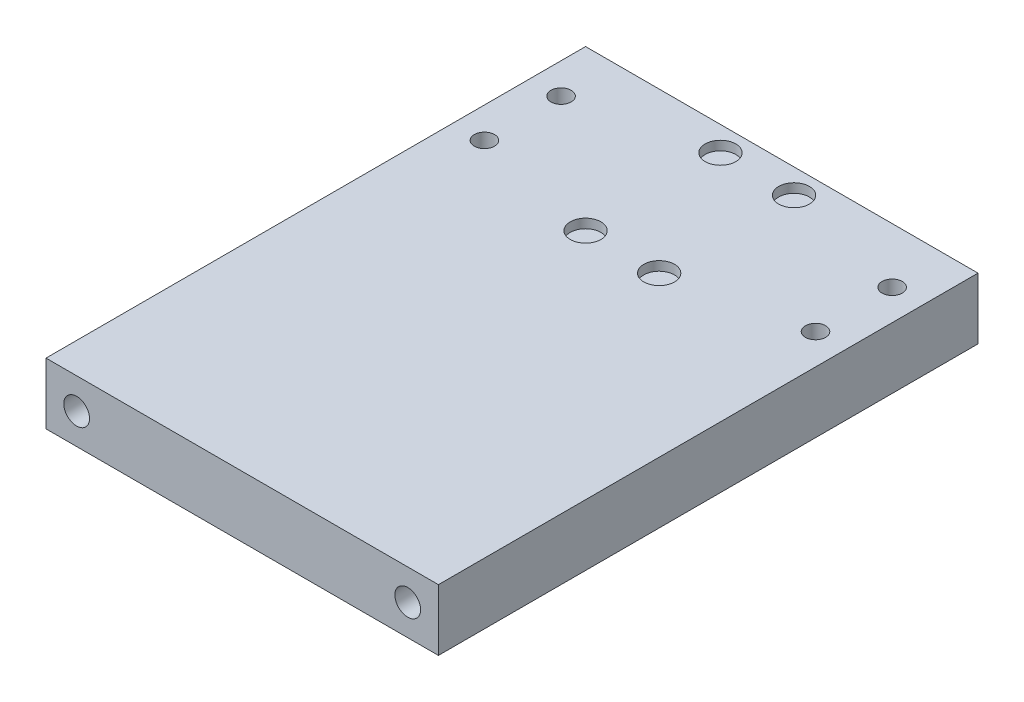
ISO-10303-21;
HEADER;
FILE_DESCRIPTION(('STEP AP214'),'2;1');
FILE_NAME('part.step','',(''),(''),'','','');
FILE_SCHEMA(('AUTOMOTIVE_DESIGN { 1 0 10303 214 1 1 1 1 }'));
ENDSEC;
DATA;
#1=APPLICATION_CONTEXT('core data for automotive mechanical design processes');
#2=APPLICATION_PROTOCOL_DEFINITION('international standard','automotive_design',2000,#1);
#3=PRODUCT_CONTEXT('',#1,'mechanical');
#4=PRODUCT('Part','Part','',(#3));
#5=PRODUCT_RELATED_PRODUCT_CATEGORY('part','',(#4));
#6=PRODUCT_DEFINITION_FORMATION('','',#4);
#7=PRODUCT_DEFINITION_CONTEXT('part definition',#1,'design');
#8=PRODUCT_DEFINITION('design','',#6,#7);
#9=PRODUCT_DEFINITION_SHAPE('','',#8);
#10=(LENGTH_UNIT() NAMED_UNIT(*) SI_UNIT(.MILLI.,.METRE.));
#11=(NAMED_UNIT(*) PLANE_ANGLE_UNIT() SI_UNIT($,.RADIAN.));
#12=(NAMED_UNIT(*) SI_UNIT($,.STERADIAN.) SOLID_ANGLE_UNIT());
#13=UNCERTAINTY_MEASURE_WITH_UNIT(LENGTH_MEASURE(1.E-05),#10,'distance_accuracy_value','');
#14=(GEOMETRIC_REPRESENTATION_CONTEXT(3) GLOBAL_UNCERTAINTY_ASSIGNED_CONTEXT((#13)) GLOBAL_UNIT_ASSIGNED_CONTEXT((#10,
#11,#12)) REPRESENTATION_CONTEXT('',''));
#15=CARTESIAN_POINT('',(0.,0.,0.));
#16=DIRECTION('',(0.,0.,1.));
#17=DIRECTION('',(1.,0.,0.));
#18=AXIS2_PLACEMENT_3D('',#15,#16,#17);
#19=CARTESIAN_POINT('',(64.,0.,0.));
#20=DIRECTION('',(0.,1.,0.));
#21=DIRECTION('',(0.,0.,1.));
#22=AXIS2_PLACEMENT_3D('',#19,#20,#21);
#23=PLANE('',#22);
#24=CARTESIAN_POINT('',(59.,0.,-89.));
#25=DIRECTION('',(0.,1.,0.));
#26=DIRECTION('',(0.,0.,1.));
#27=AXIS2_PLACEMENT_3D('',#24,#25,#26);
#28=CIRCLE('',#27,1.65);
#29=CARTESIAN_POINT('',(59.,0.,-87.35));
#30=VERTEX_POINT('',#29);
#31=EDGE_CURVE('E324',#30,#30,#28,.T.);
#32=ORIENTED_EDGE('',*,*,#31,.T.);
#33=EDGE_LOOP('',(#32));
#34=FACE_BOUND('',#33,.T.);
#35=CARTESIAN_POINT('',(59.,0.,-76.5));
#36=DIRECTION('',(0.,1.,0.));
#37=DIRECTION('',(0.,0.,1.));
#38=AXIS2_PLACEMENT_3D('',#35,#36,#37);
#39=CIRCLE('',#38,1.65);
#40=CARTESIAN_POINT('',(59.,0.,-74.85));
#41=VERTEX_POINT('',#40);
#42=EDGE_CURVE('E333',#41,#41,#39,.T.);
#43=ORIENTED_EDGE('',*,*,#42,.T.);
#44=EDGE_LOOP('',(#43));
#45=FACE_BOUND('',#44,.T.);
#46=CARTESIAN_POINT('',(5.,0.,-76.5));
#47=DIRECTION('',(0.,1.,0.));
#48=DIRECTION('',(0.,0.,1.));
#49=AXIS2_PLACEMENT_3D('',#46,#47,#48);
#50=CIRCLE('',#49,1.65);
#51=CARTESIAN_POINT('',(5.,0.,-74.85));
#52=VERTEX_POINT('',#51);
#53=EDGE_CURVE('E339',#52,#52,#50,.T.);
#54=ORIENTED_EDGE('',*,*,#53,.T.);
#55=EDGE_LOOP('',(#54));
#56=FACE_BOUND('',#55,.T.);
#57=CARTESIAN_POINT('',(5.,0.,-89.));
#58=DIRECTION('',(0.,1.,0.));
#59=DIRECTION('',(0.,0.,1.));
#60=AXIS2_PLACEMENT_3D('',#57,#58,#59);
#61=CIRCLE('',#60,1.65);
#62=CARTESIAN_POINT('',(5.,0.,-87.35));
#63=VERTEX_POINT('',#62);
#64=EDGE_CURVE('E345',#63,#63,#61,.T.);
#65=ORIENTED_EDGE('',*,*,#64,.T.);
#66=EDGE_LOOP('',(#65));
#67=FACE_BOUND('',#66,.T.);
#68=DIRECTION('',(0.,0.,-1.));
#69=VECTOR('',#68,1.);
#70=CARTESIAN_POINT('',(64.,0.,0.));
#71=LINE('',#70,#69);
#72=CARTESIAN_POINT('',(64.,0.,-10.));
#73=VERTEX_POINT('',#72);
#74=CARTESIAN_POINT('',(64.,0.,-98.));
#75=VERTEX_POINT('',#74);
#76=EDGE_CURVE('E99',#73,#75,#71,.T.);
#77=ORIENTED_EDGE('',*,*,#76,.F.);
#78=DIRECTION('',(-1.,0.,0.));
#79=VECTOR('',#78,1.);
#80=CARTESIAN_POINT('',(64.,0.,-10.));
#81=LINE('',#80,#79);
#82=CARTESIAN_POINT('',(0.,0.,-10.));
#83=VERTEX_POINT('',#82);
#84=EDGE_CURVE('E360',#73,#83,#81,.T.);
#85=ORIENTED_EDGE('',*,*,#84,.T.);
#86=DIRECTION('',(0.,0.,-1.));
#87=VECTOR('',#86,1.);
#88=CARTESIAN_POINT('',(0.,0.,0.));
#89=LINE('',#88,#87);
#90=CARTESIAN_POINT('',(0.,0.,-98.));
#91=VERTEX_POINT('',#90);
#92=EDGE_CURVE('E94',#83,#91,#89,.T.);
#93=ORIENTED_EDGE('',*,*,#92,.T.);
#94=DIRECTION('',(-1.,0.,0.));
#95=VECTOR('',#94,1.);
#96=CARTESIAN_POINT('',(64.,0.,-98.));
#97=LINE('',#96,#95);
#98=EDGE_CURVE('E106',#75,#91,#97,.T.);
#99=ORIENTED_EDGE('',*,*,#98,.F.);
#100=EDGE_LOOP('',(#77,#85,#93,#99));
#101=FACE_BOUND('',#100,.T.);
#102=ADVANCED_FACE('F36',(#34,#45,#56,#67,#101),#23,.F.);
#103=CARTESIAN_POINT('',(64.,0.,-98.));
#104=DIRECTION('',(0.,0.,1.));
#105=DIRECTION('',(1.,0.,0.));
#106=AXIS2_PLACEMENT_3D('',#103,#104,#105);
#107=PLANE('',#106);
#108=DIRECTION('',(0.,1.,0.));
#109=VECTOR('',#108,1.);
#110=CARTESIAN_POINT('',(0.,0.,-98.));
#111=LINE('',#110,#109);
#112=CARTESIAN_POINT('',(0.,10.,-98.));
#113=VERTEX_POINT('',#112);
#114=EDGE_CURVE('E66',#91,#113,#111,.T.);
#115=ORIENTED_EDGE('',*,*,#114,.T.);
#116=DIRECTION('',(-1.,0.,0.));
#117=VECTOR('',#116,1.);
#118=CARTESIAN_POINT('',(64.,10.,-98.));
#119=LINE('',#118,#117);
#120=CARTESIAN_POINT('',(64.,10.,-98.));
#121=VERTEX_POINT('',#120);
#122=EDGE_CURVE('E86',#121,#113,#119,.T.);
#123=ORIENTED_EDGE('',*,*,#122,.F.);
#124=DIRECTION('',(0.,1.,0.));
#125=VECTOR('',#124,1.);
#126=CARTESIAN_POINT('',(64.,0.,-98.));
#127=LINE('',#126,#125);
#128=EDGE_CURVE('E53',#75,#121,#127,.T.);
#129=ORIENTED_EDGE('',*,*,#128,.F.);
#130=ORIENTED_EDGE('',*,*,#98,.T.);
#131=EDGE_LOOP('',(#115,#123,#129,#130));
#132=FACE_BOUND('',#131,.T.);
#133=ADVANCED_FACE('F120',(#132),#107,.F.);
#134=CARTESIAN_POINT('',(64.,10.,-98.));
#135=DIRECTION('',(0.,-1.,0.));
#136=DIRECTION('',(0.,0.,-1.));
#137=AXIS2_PLACEMENT_3D('',#134,#135,#136);
#138=PLANE('',#137);
#139=CARTESIAN_POINT('',(59.,10.,-89.));
#140=DIRECTION('',(0.,1.,0.));
#141=DIRECTION('',(0.,0.,1.));
#142=AXIS2_PLACEMENT_3D('',#139,#140,#141);
#143=CIRCLE('',#142,1.64999999999999);
#144=CARTESIAN_POINT('',(59.,10.,-87.35));
#145=VERTEX_POINT('',#144);
#146=EDGE_CURVE('E326',#145,#145,#143,.T.);
#147=ORIENTED_EDGE('',*,*,#146,.F.);
#148=EDGE_LOOP('',(#147));
#149=FACE_BOUND('',#148,.T.);
#150=CARTESIAN_POINT('',(59.,10.,-76.5));
#151=DIRECTION('',(0.,1.,0.));
#152=DIRECTION('',(0.,0.,1.));
#153=AXIS2_PLACEMENT_3D('',#150,#151,#152);
#154=CIRCLE('',#153,1.64999999999999);
#155=CARTESIAN_POINT('',(59.,10.,-74.8500000000001));
#156=VERTEX_POINT('',#155);
#157=EDGE_CURVE('E328',#156,#156,#154,.T.);
#158=ORIENTED_EDGE('',*,*,#157,.F.);
#159=EDGE_LOOP('',(#158));
#160=FACE_BOUND('',#159,.T.);
#161=CARTESIAN_POINT('',(5.,10.,-76.5));
#162=DIRECTION('',(0.,1.,0.));
#163=DIRECTION('',(0.,0.,1.));
#164=AXIS2_PLACEMENT_3D('',#161,#162,#163);
#165=CIRCLE('',#164,1.64999999999999);
#166=CARTESIAN_POINT('',(5.,10.,-74.85));
#167=VERTEX_POINT('',#166);
#168=EDGE_CURVE('E336',#167,#167,#165,.T.);
#169=ORIENTED_EDGE('',*,*,#168,.F.);
#170=EDGE_LOOP('',(#169));
#171=FACE_BOUND('',#170,.T.);
#172=CARTESIAN_POINT('',(5.,10.,-89.));
#173=DIRECTION('',(0.,1.,0.));
#174=DIRECTION('',(0.,0.,1.));
#175=AXIS2_PLACEMENT_3D('',#172,#173,#174);
#176=CIRCLE('',#175,1.64999999999999);
#177=CARTESIAN_POINT('',(5.,10.,-87.35));
#178=VERTEX_POINT('',#177);
#179=EDGE_CURVE('E342',#178,#178,#176,.T.);
#180=ORIENTED_EDGE('',*,*,#179,.F.);
#181=EDGE_LOOP('',(#180));
#182=FACE_BOUND('',#181,.T.);
#183=CARTESIAN_POINT('',(26.,10.,-94.));
#184=DIRECTION('',(0.,1.,0.));
#185=DIRECTION('',(0.,0.,1.));
#186=AXIS2_PLACEMENT_3D('',#183,#184,#185);
#187=CIRCLE('',#186,2.5);
#188=CARTESIAN_POINT('',(26.,10.,-91.5));
#189=VERTEX_POINT('',#188);
#190=EDGE_CURVE('E362',#189,#189,#187,.T.);
#191=ORIENTED_EDGE('',*,*,#190,.F.);
#192=EDGE_LOOP('',(#191));
#193=FACE_BOUND('',#192,.T.);
#194=CARTESIAN_POINT('',(38.,10.,-94.));
#195=DIRECTION('',(0.,1.,0.));
#196=DIRECTION('',(0.,0.,1.));
#197=AXIS2_PLACEMENT_3D('',#194,#195,#196);
#198=CIRCLE('',#197,2.5);
#199=CARTESIAN_POINT('',(38.,10.,-91.5));
#200=VERTEX_POINT('',#199);
#201=EDGE_CURVE('E368',#200,#200,#198,.T.);
#202=ORIENTED_EDGE('',*,*,#201,.F.);
#203=EDGE_LOOP('',(#202));
#204=FACE_BOUND('',#203,.T.);
#205=DIRECTION('',(0.,0.,1.));
#206=VECTOR('',#205,1.);
#207=CARTESIAN_POINT('',(0.,10.,-98.));
#208=LINE('',#207,#206);
#209=CARTESIAN_POINT('',(0.,9.99999999999999,-9.99999999999999));
#210=VERTEX_POINT('',#209);
#211=EDGE_CURVE('E93',#113,#210,#208,.T.);
#212=ORIENTED_EDGE('',*,*,#211,.T.);
#213=DIRECTION('',(-1.,0.,0.));
#214=VECTOR('',#213,1.);
#215=CARTESIAN_POINT('',(64.,9.99999999999999,-9.99999999999999));
#216=LINE('',#215,#214);
#217=CARTESIAN_POINT('',(64.,9.99999999999999,-10.));
#218=VERTEX_POINT('',#217);
#219=EDGE_CURVE('E73',#218,#210,#216,.T.);
#220=ORIENTED_EDGE('',*,*,#219,.F.);
#221=DIRECTION('',(0.,0.,1.));
#222=VECTOR('',#221,1.);
#223=CARTESIAN_POINT('',(64.,10.,-98.));
#224=LINE('',#223,#222);
#225=EDGE_CURVE('E87',#121,#218,#224,.T.);
#226=ORIENTED_EDGE('',*,*,#225,.F.);
#227=ORIENTED_EDGE('',*,*,#122,.T.);
#228=EDGE_LOOP('',(#212,#220,#226,#227));
#229=FACE_BOUND('',#228,.T.);
#230=CARTESIAN_POINT('',(38.,9.99999999999999,-72.));
#231=DIRECTION('',(0.,1.,0.));
#232=DIRECTION('',(0.,0.,1.));
#233=AXIS2_PLACEMENT_3D('',#230,#231,#232);
#234=CIRCLE('',#233,2.5);
#235=CARTESIAN_POINT('',(38.,9.99999999999999,-69.5));
#236=VERTEX_POINT('',#235);
#237=EDGE_CURVE('E108',#236,#236,#234,.T.);
#238=ORIENTED_EDGE('',*,*,#237,.F.);
#239=EDGE_LOOP('',(#238));
#240=FACE_BOUND('',#239,.T.);
#241=CARTESIAN_POINT('',(26.,9.99999999999999,-72.));
#242=DIRECTION('',(0.,1.,0.));
#243=DIRECTION('',(0.,0.,1.));
#244=AXIS2_PLACEMENT_3D('',#241,#242,#243);
#245=CIRCLE('',#244,2.5);
#246=CARTESIAN_POINT('',(26.,9.99999999999999,-69.5));
#247=VERTEX_POINT('',#246);
#248=EDGE_CURVE('E45',#247,#247,#245,.T.);
#249=ORIENTED_EDGE('',*,*,#248,.F.);
#250=EDGE_LOOP('',(#249));
#251=FACE_BOUND('',#250,.T.);
#252=ADVANCED_FACE('F97',(#149,#160,#171,#182,#193,#204,#229,#240,#251),#138,.F.);
#253=CARTESIAN_POINT('',(64.,0.,0.));
#254=DIRECTION('',(1.,0.,0.));
#255=DIRECTION('',(0.,0.,-1.));
#256=AXIS2_PLACEMENT_3D('',#253,#254,#255);
#257=PLANE('',#256);
#258=DIRECTION('',(0.,-1.,0.));
#259=VECTOR('',#258,1.);
#260=CARTESIAN_POINT('',(64.,60.5,-10.));
#261=LINE('',#260,#259);
#262=EDGE_CURVE('E82',#218,#73,#261,.T.);
#263=ORIENTED_EDGE('',*,*,#262,.T.);
#264=ORIENTED_EDGE('',*,*,#76,.T.);
#265=ORIENTED_EDGE('',*,*,#128,.T.);
#266=ORIENTED_EDGE('',*,*,#225,.T.);
#267=EDGE_LOOP('',(#263,#264,#265,#266));
#268=FACE_BOUND('',#267,.T.);
#269=ADVANCED_FACE('F119',(#268),#257,.T.);
#270=CARTESIAN_POINT('',(0.,0.,0.));
#271=DIRECTION('',(1.,0.,0.));
#272=DIRECTION('',(0.,0.,-1.));
#273=AXIS2_PLACEMENT_3D('',#270,#271,#272);
#274=PLANE('',#273);
#275=ORIENTED_EDGE('',*,*,#92,.F.);
#276=DIRECTION('',(0.,-1.,0.));
#277=VECTOR('',#276,1.);
#278=CARTESIAN_POINT('',(0.,60.5,-10.));
#279=LINE('',#278,#277);
#280=EDGE_CURVE('E78',#210,#83,#279,.T.);
#281=ORIENTED_EDGE('',*,*,#280,.F.);
#282=ORIENTED_EDGE('',*,*,#211,.F.);
#283=ORIENTED_EDGE('',*,*,#114,.F.);
#284=EDGE_LOOP('',(#275,#281,#282,#283));
#285=FACE_BOUND('',#284,.T.);
#286=ADVANCED_FACE('F92',(#285),#274,.F.);
#287=CARTESIAN_POINT('',(38.,8.5,-94.));
#288=DIRECTION('',(0.,1.,0.));
#289=DIRECTION('',(0.,0.,1.));
#290=AXIS2_PLACEMENT_3D('',#287,#288,#289);
#291=CYLINDRICAL_SURFACE('',#290,2.5);
#292=CARTESIAN_POINT('',(38.,8.5,-94.));
#293=DIRECTION('',(0.,1.,0.));
#294=DIRECTION('',(0.,0.,1.));
#295=AXIS2_PLACEMENT_3D('',#292,#293,#294);
#296=CIRCLE('',#295,2.5);
#297=CARTESIAN_POINT('',(38.,8.5,-91.5));
#298=VERTEX_POINT('',#297);
#299=EDGE_CURVE('E369',#298,#298,#296,.T.);
#300=ORIENTED_EDGE('',*,*,#299,.F.);
#301=EDGE_LOOP('',(#300));
#302=FACE_BOUND('',#301,.T.);
#303=ORIENTED_EDGE('',*,*,#201,.T.);
#304=EDGE_LOOP('',(#303));
#305=FACE_BOUND('',#304,.T.);
#306=ADVANCED_FACE('F191',(#302,#305),#291,.F.);
#307=CARTESIAN_POINT('',(38.,8.5,-94.));
#308=DIRECTION('',(0.,1.,0.));
#309=DIRECTION('',(0.,0.,1.));
#310=AXIS2_PLACEMENT_3D('',#307,#308,#309);
#311=PLANE('',#310);
#312=ORIENTED_EDGE('',*,*,#299,.T.);
#313=EDGE_LOOP('',(#312));
#314=FACE_BOUND('',#313,.T.);
#315=ADVANCED_FACE('F183',(#314),#311,.T.);
#316=CARTESIAN_POINT('',(26.,8.5,-94.));
#317=DIRECTION('',(0.,1.,0.));
#318=DIRECTION('',(0.,0.,1.));
#319=AXIS2_PLACEMENT_3D('',#316,#317,#318);
#320=CYLINDRICAL_SURFACE('',#319,2.5);
#321=CARTESIAN_POINT('',(26.,8.5,-94.));
#322=DIRECTION('',(0.,1.,0.));
#323=DIRECTION('',(0.,0.,1.));
#324=AXIS2_PLACEMENT_3D('',#321,#322,#323);
#325=CIRCLE('',#324,2.5);
#326=CARTESIAN_POINT('',(26.,8.5,-91.5));
#327=VERTEX_POINT('',#326);
#328=EDGE_CURVE('E365',#327,#327,#325,.T.);
#329=ORIENTED_EDGE('',*,*,#328,.F.);
#330=EDGE_LOOP('',(#329));
#331=FACE_BOUND('',#330,.T.);
#332=ORIENTED_EDGE('',*,*,#190,.T.);
#333=EDGE_LOOP('',(#332));
#334=FACE_BOUND('',#333,.T.);
#335=ADVANCED_FACE('F175',(#331,#334),#320,.F.);
#336=CARTESIAN_POINT('',(26.,8.5,-94.));
#337=DIRECTION('',(0.,1.,0.));
#338=DIRECTION('',(0.,0.,1.));
#339=AXIS2_PLACEMENT_3D('',#336,#337,#338);
#340=PLANE('',#339);
#341=ORIENTED_EDGE('',*,*,#328,.T.);
#342=EDGE_LOOP('',(#341));
#343=FACE_BOUND('',#342,.T.);
#344=ADVANCED_FACE('F146',(#343),#340,.T.);
#345=CARTESIAN_POINT('',(38.,8.49999999999999,-72.));
#346=DIRECTION('',(0.,1.,0.));
#347=DIRECTION('',(0.,0.,1.));
#348=AXIS2_PLACEMENT_3D('',#345,#346,#347);
#349=PLANE('',#348);
#350=CARTESIAN_POINT('',(38.,8.49999999999999,-72.));
#351=DIRECTION('',(0.,1.,0.));
#352=DIRECTION('',(0.,0.,1.));
#353=AXIS2_PLACEMENT_3D('',#350,#351,#352);
#354=CIRCLE('',#353,2.5);
#355=CARTESIAN_POINT('',(38.,8.49999999999999,-69.5));
#356=VERTEX_POINT('',#355);
#357=EDGE_CURVE('E111',#356,#356,#354,.T.);
#358=ORIENTED_EDGE('',*,*,#357,.T.);
#359=EDGE_LOOP('',(#358));
#360=FACE_BOUND('',#359,.T.);
#361=ADVANCED_FACE('F143',(#360),#349,.T.);
#362=CARTESIAN_POINT('',(38.,8.49999999999999,-72.));
#363=DIRECTION('',(0.,1.,0.));
#364=DIRECTION('',(0.,0.,1.));
#365=AXIS2_PLACEMENT_3D('',#362,#363,#364);
#366=CYLINDRICAL_SURFACE('',#365,2.5);
#367=ORIENTED_EDGE('',*,*,#357,.F.);
#368=EDGE_LOOP('',(#367));
#369=FACE_BOUND('',#368,.T.);
#370=ORIENTED_EDGE('',*,*,#237,.T.);
#371=EDGE_LOOP('',(#370));
#372=FACE_BOUND('',#371,.T.);
#373=ADVANCED_FACE('F140',(#369,#372),#366,.F.);
#374=CARTESIAN_POINT('',(26.,8.49999999999999,-72.));
#375=DIRECTION('',(0.,1.,0.));
#376=DIRECTION('',(0.,0.,1.));
#377=AXIS2_PLACEMENT_3D('',#374,#375,#376);
#378=PLANE('',#377);
#379=CARTESIAN_POINT('',(26.,8.49999999999999,-72.));
#380=DIRECTION('',(0.,1.,0.));
#381=DIRECTION('',(0.,0.,1.));
#382=AXIS2_PLACEMENT_3D('',#379,#380,#381);
#383=CIRCLE('',#382,2.5);
#384=CARTESIAN_POINT('',(26.,8.49999999999999,-69.5));
#385=VERTEX_POINT('',#384);
#386=EDGE_CURVE('E11',#385,#385,#383,.T.);
#387=ORIENTED_EDGE('',*,*,#386,.T.);
#388=EDGE_LOOP('',(#387));
#389=FACE_BOUND('',#388,.T.);
#390=ADVANCED_FACE('F38',(#389),#378,.T.);
#391=CARTESIAN_POINT('',(26.,8.49999999999999,-72.));
#392=DIRECTION('',(0.,1.,0.));
#393=DIRECTION('',(0.,0.,1.));
#394=AXIS2_PLACEMENT_3D('',#391,#392,#393);
#395=CYLINDRICAL_SURFACE('',#394,2.5);
#396=ORIENTED_EDGE('',*,*,#386,.F.);
#397=EDGE_LOOP('',(#396));
#398=FACE_BOUND('',#397,.T.);
#399=ORIENTED_EDGE('',*,*,#248,.T.);
#400=EDGE_LOOP('',(#399));
#401=FACE_BOUND('',#400,.T.);
#402=ADVANCED_FACE('F116',(#398,#401),#395,.F.);
#403=CARTESIAN_POINT('',(64.,60.5,-10.));
#404=DIRECTION('',(0.,0.,-1.));
#405=DIRECTION('',(-1.,0.,0.));
#406=AXIS2_PLACEMENT_3D('',#403,#404,#405);
#407=PLANE('',#406);
#408=CARTESIAN_POINT('',(59.,5.,-10.));
#409=DIRECTION('',(0.,0.,1.));
#410=DIRECTION('',(1.,0.,0.));
#411=AXIS2_PLACEMENT_3D('',#408,#409,#410);
#412=CIRCLE('',#411,2.09999999999999);
#413=CARTESIAN_POINT('',(61.1,5.,-10.));
#414=VERTEX_POINT('',#413);
#415=EDGE_CURVE('E348',#414,#414,#412,.T.);
#416=ORIENTED_EDGE('',*,*,#415,.F.);
#417=EDGE_LOOP('',(#416));
#418=FACE_BOUND('',#417,.T.);
#419=CARTESIAN_POINT('',(5.,5.,-10.));
#420=DIRECTION('',(0.,0.,1.));
#421=DIRECTION('',(1.,0.,0.));
#422=AXIS2_PLACEMENT_3D('',#419,#420,#421);
#423=CIRCLE('',#422,2.09999999999999);
#424=CARTESIAN_POINT('',(7.09999999999999,5.,-10.));
#425=VERTEX_POINT('',#424);
#426=EDGE_CURVE('E354',#425,#425,#423,.T.);
#427=ORIENTED_EDGE('',*,*,#426,.F.);
#428=EDGE_LOOP('',(#427));
#429=FACE_BOUND('',#428,.T.);
#430=ORIENTED_EDGE('',*,*,#262,.F.);
#431=ORIENTED_EDGE('',*,*,#219,.T.);
#432=ORIENTED_EDGE('',*,*,#280,.T.);
#433=ORIENTED_EDGE('',*,*,#84,.F.);
#434=EDGE_LOOP('',(#430,#431,#432,#433));
#435=FACE_BOUND('',#434,.T.);
#436=ADVANCED_FACE('F75',(#418,#429,#435),#407,.F.);
#437=CARTESIAN_POINT('',(5.,5.,-28.));
#438=DIRECTION('',(0.,0.,1.));
#439=DIRECTION('',(1.,0.,0.));
#440=AXIS2_PLACEMENT_3D('',#437,#438,#439);
#441=CONICAL_SURFACE('',#440,2.1,1.02974425867665);
#442=CARTESIAN_POINT('',(4.99999999999999,5.,-29.2618072999579));
#443=VERTEX_POINT('',#442);
#444=VERTEX_LOOP('',#443);
#445=FACE_BOUND('',#444,.T.);
#446=CARTESIAN_POINT('',(5.,5.,-28.));
#447=DIRECTION('',(0.,0.,1.));
#448=DIRECTION('',(1.,0.,0.));
#449=AXIS2_PLACEMENT_3D('',#446,#447,#448);
#450=CIRCLE('',#449,2.1);
#451=CARTESIAN_POINT('',(7.09999999999999,5.,-28.));
#452=VERTEX_POINT('',#451);
#453=EDGE_CURVE('E95',#452,#452,#450,.T.);
#454=ORIENTED_EDGE('',*,*,#453,.T.);
#455=EDGE_LOOP('',(#454));
#456=FACE_BOUND('',#455,.T.);
#457=ADVANCED_FACE('F154',(#445,#456),#441,.F.);
#458=CARTESIAN_POINT('',(5.,5.,-10.));
#459=DIRECTION('',(0.,0.,1.));
#460=DIRECTION('',(1.,0.,0.));
#461=AXIS2_PLACEMENT_3D('',#458,#459,#460);
#462=CYLINDRICAL_SURFACE('',#461,2.09999999999999);
#463=ORIENTED_EDGE('',*,*,#453,.F.);
#464=EDGE_LOOP('',(#463));
#465=FACE_BOUND('',#464,.T.);
#466=ORIENTED_EDGE('',*,*,#426,.T.);
#467=EDGE_LOOP('',(#466));
#468=FACE_BOUND('',#467,.T.);
#469=ADVANCED_FACE('F232',(#465,#468),#462,.F.);
#470=CARTESIAN_POINT('',(59.,5.,-28.));
#471=DIRECTION('',(0.,0.,1.));
#472=DIRECTION('',(1.,0.,0.));
#473=AXIS2_PLACEMENT_3D('',#470,#471,#472);
#474=CONICAL_SURFACE('',#473,2.1,1.02974425867665);
#475=CARTESIAN_POINT('',(59.,5.,-29.2618072999579));
#476=VERTEX_POINT('',#475);
#477=VERTEX_LOOP('',#476);
#478=FACE_BOUND('',#477,.T.);
#479=CARTESIAN_POINT('',(59.,5.,-28.));
#480=DIRECTION('',(0.,0.,1.));
#481=DIRECTION('',(1.,0.,0.));
#482=AXIS2_PLACEMENT_3D('',#479,#480,#481);
#483=CIRCLE('',#482,2.1);
#484=CARTESIAN_POINT('',(61.1,5.,-28.));
#485=VERTEX_POINT('',#484);
#486=EDGE_CURVE('E351',#485,#485,#483,.T.);
#487=ORIENTED_EDGE('',*,*,#486,.T.);
#488=EDGE_LOOP('',(#487));
#489=FACE_BOUND('',#488,.T.);
#490=ADVANCED_FACE('F241',(#478,#489),#474,.F.);
#491=CARTESIAN_POINT('',(59.,5.,-10.));
#492=DIRECTION('',(0.,0.,1.));
#493=DIRECTION('',(1.,0.,0.));
#494=AXIS2_PLACEMENT_3D('',#491,#492,#493);
#495=CYLINDRICAL_SURFACE('',#494,2.09999999999999);
#496=ORIENTED_EDGE('',*,*,#486,.F.);
#497=EDGE_LOOP('',(#496));
#498=FACE_BOUND('',#497,.T.);
#499=ORIENTED_EDGE('',*,*,#415,.T.);
#500=EDGE_LOOP('',(#499));
#501=FACE_BOUND('',#500,.T.);
#502=ADVANCED_FACE('F251',(#498,#501),#495,.F.);
#503=CARTESIAN_POINT('',(5.,10.,-89.));
#504=DIRECTION('',(0.,1.,0.));
#505=DIRECTION('',(0.,0.,1.));
#506=AXIS2_PLACEMENT_3D('',#503,#504,#505);
#507=CYLINDRICAL_SURFACE('',#506,1.64999999999999);
#508=ORIENTED_EDGE('',*,*,#64,.F.);
#509=EDGE_LOOP('',(#508));
#510=FACE_BOUND('',#509,.T.);
#511=ORIENTED_EDGE('',*,*,#179,.T.);
#512=EDGE_LOOP('',(#511));
#513=FACE_BOUND('',#512,.T.);
#514=ADVANCED_FACE('F260',(#510,#513),#507,.F.);
#515=CARTESIAN_POINT('',(5.,10.,-76.5));
#516=DIRECTION('',(0.,1.,0.));
#517=DIRECTION('',(0.,0.,1.));
#518=AXIS2_PLACEMENT_3D('',#515,#516,#517);
#519=CYLINDRICAL_SURFACE('',#518,1.64999999999999);
#520=ORIENTED_EDGE('',*,*,#53,.F.);
#521=EDGE_LOOP('',(#520));
#522=FACE_BOUND('',#521,.T.);
#523=ORIENTED_EDGE('',*,*,#168,.T.);
#524=EDGE_LOOP('',(#523));
#525=FACE_BOUND('',#524,.T.);
#526=ADVANCED_FACE('F270',(#522,#525),#519,.F.);
#527=CARTESIAN_POINT('',(59.,10.,-76.5));
#528=DIRECTION('',(0.,1.,0.));
#529=DIRECTION('',(0.,0.,1.));
#530=AXIS2_PLACEMENT_3D('',#527,#528,#529);
#531=CYLINDRICAL_SURFACE('',#530,1.65);
#532=ORIENTED_EDGE('',*,*,#42,.F.);
#533=EDGE_LOOP('',(#532));
#534=FACE_BOUND('',#533,.T.);
#535=ORIENTED_EDGE('',*,*,#157,.T.);
#536=EDGE_LOOP('',(#535));
#537=FACE_BOUND('',#536,.T.);
#538=ADVANCED_FACE('F280',(#534,#537),#531,.F.);
#539=CARTESIAN_POINT('',(59.,10.,-89.));
#540=DIRECTION('',(0.,1.,0.));
#541=DIRECTION('',(0.,0.,1.));
#542=AXIS2_PLACEMENT_3D('',#539,#540,#541);
#543=CYLINDRICAL_SURFACE('',#542,1.65);
#544=ORIENTED_EDGE('',*,*,#31,.F.);
#545=EDGE_LOOP('',(#544));
#546=FACE_BOUND('',#545,.T.);
#547=ORIENTED_EDGE('',*,*,#146,.T.);
#548=EDGE_LOOP('',(#547));
#549=FACE_BOUND('',#548,.T.);
#550=ADVANCED_FACE('F290',(#546,#549),#543,.F.);
#551=CLOSED_SHELL('',(#102,#133,#252,#269,#286,#306,#315,#335,#344,#361,#373,#390,#402,#436,
#457,#469,#490,#502,#514,#526,#538,#550));
#552=MANIFOLD_SOLID_BREP('B2',#551);
#553=ADVANCED_BREP_SHAPE_REPRESENTATION('',(#18,#552),#14);
#554=SHAPE_DEFINITION_REPRESENTATION(#9,#553);
ENDSEC;
END-ISO-10303-21;
